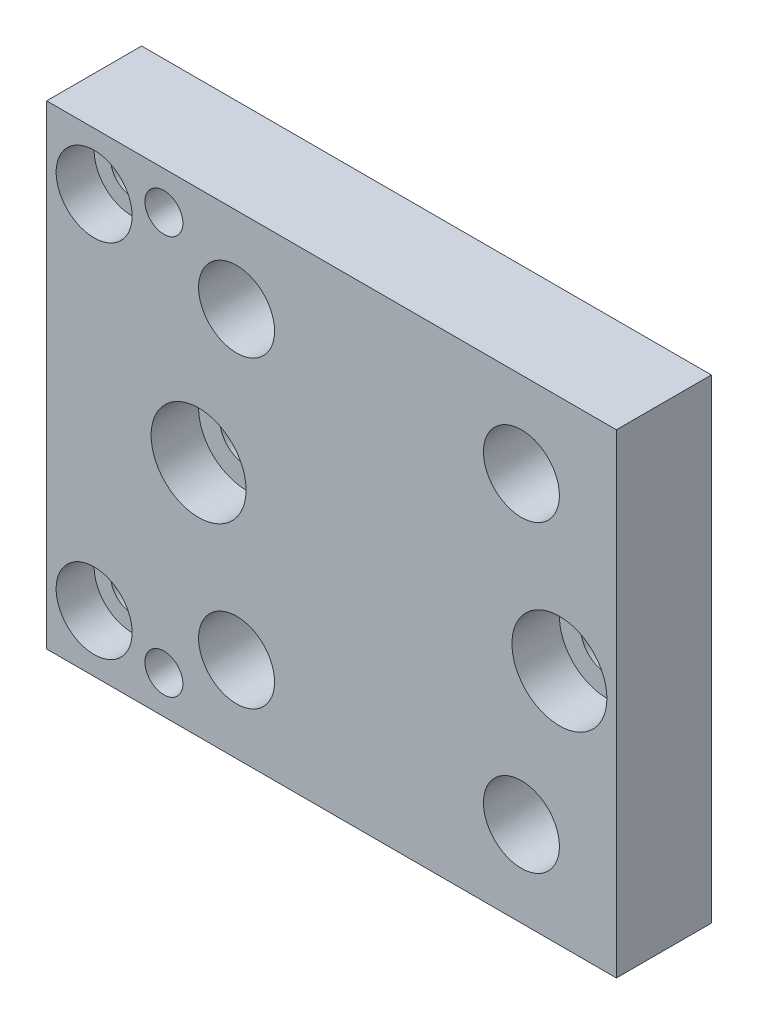
ISO-10303-21;
HEADER;
FILE_DESCRIPTION(('STEP AP214'),'2;1');
FILE_NAME('part.step','',(''),(''),'','','');
FILE_SCHEMA(('AUTOMOTIVE_DESIGN { 1 0 10303 214 1 1 1 1 }'));
ENDSEC;
DATA;
#1=APPLICATION_CONTEXT('core data for automotive mechanical design processes');
#2=APPLICATION_PROTOCOL_DEFINITION('international standard','automotive_design',2000,#1);
#3=PRODUCT_CONTEXT('',#1,'mechanical');
#4=PRODUCT('Part','Part','',(#3));
#5=PRODUCT_RELATED_PRODUCT_CATEGORY('part','',(#4));
#6=PRODUCT_DEFINITION_FORMATION('','',#4);
#7=PRODUCT_DEFINITION_CONTEXT('part definition',#1,'design');
#8=PRODUCT_DEFINITION('design','',#6,#7);
#9=PRODUCT_DEFINITION_SHAPE('','',#8);
#10=(LENGTH_UNIT() NAMED_UNIT(*) SI_UNIT(.MILLI.,.METRE.));
#11=(NAMED_UNIT(*) PLANE_ANGLE_UNIT() SI_UNIT($,.RADIAN.));
#12=(NAMED_UNIT(*) SI_UNIT($,.STERADIAN.) SOLID_ANGLE_UNIT());
#13=UNCERTAINTY_MEASURE_WITH_UNIT(LENGTH_MEASURE(1.E-05),#10,'distance_accuracy_value','');
#14=(GEOMETRIC_REPRESENTATION_CONTEXT(3) GLOBAL_UNCERTAINTY_ASSIGNED_CONTEXT((#13)) GLOBAL_UNIT_ASSIGNED_CONTEXT((#10,
#11,#12)) REPRESENTATION_CONTEXT('',''));
#15=CARTESIAN_POINT('',(0.,0.,0.));
#16=DIRECTION('',(0.,0.,1.));
#17=DIRECTION('',(1.,0.,0.));
#18=AXIS2_PLACEMENT_3D('',#15,#16,#17);
#19=CARTESIAN_POINT('',(-6.,25.,10.));
#20=DIRECTION('',(0.,0.,-1.));
#21=DIRECTION('',(-1.,0.,0.));
#22=AXIS2_PLACEMENT_3D('',#19,#20,#21);
#23=CYLINDRICAL_SURFACE('',#22,2.75);
#24=CARTESIAN_POINT('',(-6.,25.,0.));
#25=DIRECTION('',(0.,0.,1.));
#26=DIRECTION('',(1.,0.,0.));
#27=AXIS2_PLACEMENT_3D('',#24,#25,#26);
#28=CIRCLE('',#27,2.75);
#29=CARTESIAN_POINT('',(-3.25,25.,0.));
#30=VERTEX_POINT('',#29);
#31=EDGE_CURVE('E153',#30,#30,#28,.T.);
#32=ORIENTED_EDGE('',*,*,#31,.F.);
#33=EDGE_LOOP('',(#32));
#34=FACE_BOUND('',#33,.T.);
#35=CARTESIAN_POINT('',(-6.,25.,5.));
#36=DIRECTION('',(0.,0.,1.));
#37=DIRECTION('',(1.,0.,0.));
#38=AXIS2_PLACEMENT_3D('',#35,#36,#37);
#39=CIRCLE('',#38,2.75);
#40=CARTESIAN_POINT('',(-3.25,25.,5.));
#41=VERTEX_POINT('',#40);
#42=EDGE_CURVE('E37',#41,#41,#39,.T.);
#43=ORIENTED_EDGE('',*,*,#42,.T.);
#44=EDGE_LOOP('',(#43));
#45=FACE_BOUND('',#44,.T.);
#46=ADVANCED_FACE('F33',(#34,#45),#23,.F.);
#47=CARTESIAN_POINT('',(-44.,25.,10.));
#48=DIRECTION('',(0.,0.,-1.));
#49=DIRECTION('',(-1.,0.,0.));
#50=AXIS2_PLACEMENT_3D('',#47,#48,#49);
#51=CYLINDRICAL_SURFACE('',#50,2.75);
#52=CARTESIAN_POINT('',(-44.,25.,0.));
#53=DIRECTION('',(0.,0.,1.));
#54=DIRECTION('',(1.,0.,0.));
#55=AXIS2_PLACEMENT_3D('',#52,#53,#54);
#56=CIRCLE('',#55,2.75);
#57=CARTESIAN_POINT('',(-41.25,25.,0.));
#58=VERTEX_POINT('',#57);
#59=EDGE_CURVE('E158',#58,#58,#56,.T.);
#60=ORIENTED_EDGE('',*,*,#59,.F.);
#61=EDGE_LOOP('',(#60));
#62=FACE_BOUND('',#61,.T.);
#63=CARTESIAN_POINT('',(-44.,25.,5.));
#64=DIRECTION('',(0.,0.,1.));
#65=DIRECTION('',(1.,0.,0.));
#66=AXIS2_PLACEMENT_3D('',#63,#64,#65);
#67=CIRCLE('',#66,2.75);
#68=CARTESIAN_POINT('',(-41.25,25.,5.));
#69=VERTEX_POINT('',#68);
#70=EDGE_CURVE('E119',#69,#69,#67,.T.);
#71=ORIENTED_EDGE('',*,*,#70,.T.);
#72=EDGE_LOOP('',(#71));
#73=FACE_BOUND('',#72,.T.);
#74=ADVANCED_FACE('F210',(#62,#73),#51,.F.);
#75=CARTESIAN_POINT('',(-55.,5.99999999999999,10.));
#76=DIRECTION('',(0.,0.,-1.));
#77=DIRECTION('',(-1.,0.,0.));
#78=AXIS2_PLACEMENT_3D('',#75,#76,#77);
#79=CYLINDRICAL_SURFACE('',#78,2.25);
#80=CARTESIAN_POINT('',(-55.,5.99999999999999,0.));
#81=DIRECTION('',(0.,0.,1.));
#82=DIRECTION('',(1.,0.,0.));
#83=AXIS2_PLACEMENT_3D('',#80,#81,#82);
#84=CIRCLE('',#83,2.25);
#85=CARTESIAN_POINT('',(-52.75,5.99999999999999,0.));
#86=VERTEX_POINT('',#85);
#87=EDGE_CURVE('E161',#86,#86,#84,.T.);
#88=ORIENTED_EDGE('',*,*,#87,.F.);
#89=EDGE_LOOP('',(#88));
#90=FACE_BOUND('',#89,.T.);
#91=CARTESIAN_POINT('',(-55.,5.99999999999999,6.));
#92=DIRECTION('',(0.,0.,1.));
#93=DIRECTION('',(1.,0.,0.));
#94=AXIS2_PLACEMENT_3D('',#91,#92,#93);
#95=CIRCLE('',#94,2.25);
#96=CARTESIAN_POINT('',(-52.75,5.99999999999999,6.));
#97=VERTEX_POINT('',#96);
#98=EDGE_CURVE('E115',#97,#97,#95,.T.);
#99=ORIENTED_EDGE('',*,*,#98,.T.);
#100=EDGE_LOOP('',(#99));
#101=FACE_BOUND('',#100,.T.);
#102=ADVANCED_FACE('F216',(#90,#101),#79,.F.);
#103=CARTESIAN_POINT('',(-55.,44.,10.));
#104=DIRECTION('',(0.,0.,-1.));
#105=DIRECTION('',(-1.,0.,0.));
#106=AXIS2_PLACEMENT_3D('',#103,#104,#105);
#107=CYLINDRICAL_SURFACE('',#106,2.25);
#108=CARTESIAN_POINT('',(-55.,44.,0.));
#109=DIRECTION('',(0.,0.,1.));
#110=DIRECTION('',(1.,0.,0.));
#111=AXIS2_PLACEMENT_3D('',#108,#109,#110);
#112=CIRCLE('',#111,2.25);
#113=CARTESIAN_POINT('',(-52.75,44.,0.));
#114=VERTEX_POINT('',#113);
#115=EDGE_CURVE('E164',#114,#114,#112,.T.);
#116=ORIENTED_EDGE('',*,*,#115,.F.);
#117=EDGE_LOOP('',(#116));
#118=FACE_BOUND('',#117,.T.);
#119=CARTESIAN_POINT('',(-55.,44.,6.));
#120=DIRECTION('',(0.,0.,1.));
#121=DIRECTION('',(1.,0.,0.));
#122=AXIS2_PLACEMENT_3D('',#119,#120,#121);
#123=CIRCLE('',#122,2.25);
#124=CARTESIAN_POINT('',(-52.75,44.,6.));
#125=VERTEX_POINT('',#124);
#126=EDGE_CURVE('E110',#125,#125,#123,.T.);
#127=ORIENTED_EDGE('',*,*,#126,.T.);
#128=EDGE_LOOP('',(#127));
#129=FACE_BOUND('',#128,.T.);
#130=ADVANCED_FACE('F227',(#118,#129),#107,.F.);
#131=CARTESIAN_POINT('',(0.,0.,10.));
#132=DIRECTION('',(0.,0.,1.));
#133=DIRECTION('',(1.,0.,0.));
#134=AXIS2_PLACEMENT_3D('',#131,#132,#133);
#135=PLANE('',#134);
#136=CARTESIAN_POINT('',(-6.,25.,10.));
#137=DIRECTION('',(0.,0.,1.));
#138=DIRECTION('',(1.,0.,0.));
#139=AXIS2_PLACEMENT_3D('',#136,#137,#138);
#140=CIRCLE('',#139,5.);
#141=CARTESIAN_POINT('',(-0.999999999999999,25.,10.));
#142=VERTEX_POINT('',#141);
#143=EDGE_CURVE('E135',#142,#142,#140,.T.);
#144=ORIENTED_EDGE('',*,*,#143,.F.);
#145=EDGE_LOOP('',(#144));
#146=FACE_BOUND('',#145,.T.);
#147=CARTESIAN_POINT('',(-44.,25.,10.));
#148=DIRECTION('',(0.,0.,1.));
#149=DIRECTION('',(1.,0.,0.));
#150=AXIS2_PLACEMENT_3D('',#147,#148,#149);
#151=CIRCLE('',#150,5.);
#152=CARTESIAN_POINT('',(-39.,25.,10.));
#153=VERTEX_POINT('',#152);
#154=EDGE_CURVE('E128',#153,#153,#151,.T.);
#155=ORIENTED_EDGE('',*,*,#154,.F.);
#156=EDGE_LOOP('',(#155));
#157=FACE_BOUND('',#156,.T.);
#158=CARTESIAN_POINT('',(-55.,5.99999999999999,10.));
#159=DIRECTION('',(0.,0.,1.));
#160=DIRECTION('',(1.,0.,0.));
#161=AXIS2_PLACEMENT_3D('',#158,#159,#160);
#162=CIRCLE('',#161,4.);
#163=CARTESIAN_POINT('',(-51.,5.99999999999999,10.));
#164=VERTEX_POINT('',#163);
#165=EDGE_CURVE('E121',#164,#164,#162,.T.);
#166=ORIENTED_EDGE('',*,*,#165,.F.);
#167=EDGE_LOOP('',(#166));
#168=FACE_BOUND('',#167,.T.);
#169=CARTESIAN_POINT('',(-55.,44.,10.));
#170=DIRECTION('',(0.,0.,1.));
#171=DIRECTION('',(1.,0.,0.));
#172=AXIS2_PLACEMENT_3D('',#169,#170,#171);
#173=CIRCLE('',#172,4.);
#174=CARTESIAN_POINT('',(-51.,44.,10.));
#175=VERTEX_POINT('',#174);
#176=EDGE_CURVE('E117',#175,#175,#173,.T.);
#177=ORIENTED_EDGE('',*,*,#176,.F.);
#178=EDGE_LOOP('',(#177));
#179=FACE_BOUND('',#178,.T.);
#180=CARTESIAN_POINT('',(-47.6524990671277,46.,10.));
#181=DIRECTION('',(0.,0.,1.));
#182=DIRECTION('',(1.,0.,0.));
#183=AXIS2_PLACEMENT_3D('',#180,#181,#182);
#184=CIRCLE('',#183,2.);
#185=CARTESIAN_POINT('',(-45.6524990671277,46.,10.));
#186=VERTEX_POINT('',#185);
#187=EDGE_CURVE('E150',#186,#186,#184,.T.);
#188=ORIENTED_EDGE('',*,*,#187,.F.);
#189=EDGE_LOOP('',(#188));
#190=FACE_BOUND('',#189,.T.);
#191=CARTESIAN_POINT('',(-40.,9.,10.));
#192=DIRECTION('',(0.,0.,1.));
#193=DIRECTION('',(1.,0.,0.));
#194=AXIS2_PLACEMENT_3D('',#191,#192,#193);
#195=CIRCLE('',#194,4.00000000000001);
#196=CARTESIAN_POINT('',(-36.,9.,10.));
#197=VERTEX_POINT('',#196);
#198=EDGE_CURVE('E174',#197,#197,#195,.T.);
#199=ORIENTED_EDGE('',*,*,#198,.F.);
#200=EDGE_LOOP('',(#199));
#201=FACE_BOUND('',#200,.T.);
#202=CARTESIAN_POINT('',(-10.,41.,10.));
#203=DIRECTION('',(0.,0.,1.));
#204=DIRECTION('',(1.,0.,0.));
#205=AXIS2_PLACEMENT_3D('',#202,#203,#204);
#206=CIRCLE('',#205,4.);
#207=CARTESIAN_POINT('',(-6.,41.,10.));
#208=VERTEX_POINT('',#207);
#209=EDGE_CURVE('E104',#208,#208,#206,.T.);
#210=ORIENTED_EDGE('',*,*,#209,.F.);
#211=EDGE_LOOP('',(#210));
#212=FACE_BOUND('',#211,.T.);
#213=DIRECTION('',(0.,1.,0.));
#214=VECTOR('',#213,1.);
#215=CARTESIAN_POINT('',(0.,0.,10.));
#216=LINE('',#215,#214);
#217=CARTESIAN_POINT('',(0.,0.,10.));
#218=VERTEX_POINT('',#217);
#219=CARTESIAN_POINT('',(0.,50.,10.));
#220=VERTEX_POINT('',#219);
#221=EDGE_CURVE('E88',#218,#220,#216,.T.);
#222=ORIENTED_EDGE('',*,*,#221,.T.);
#223=DIRECTION('',(-1.,0.,0.));
#224=VECTOR('',#223,1.);
#225=CARTESIAN_POINT('',(0.,50.,10.));
#226=LINE('',#225,#224);
#227=CARTESIAN_POINT('',(-60.,50.,10.));
#228=VERTEX_POINT('',#227);
#229=EDGE_CURVE('E82',#220,#228,#226,.T.);
#230=ORIENTED_EDGE('',*,*,#229,.T.);
#231=DIRECTION('',(0.,-1.,0.));
#232=VECTOR('',#231,1.);
#233=CARTESIAN_POINT('',(-60.,0.,10.));
#234=LINE('',#233,#232);
#235=CARTESIAN_POINT('',(-60.,0.,10.));
#236=VERTEX_POINT('',#235);
#237=EDGE_CURVE('E86',#228,#236,#234,.T.);
#238=ORIENTED_EDGE('',*,*,#237,.T.);
#239=DIRECTION('',(1.,0.,0.));
#240=VECTOR('',#239,1.);
#241=CARTESIAN_POINT('',(0.,0.,10.));
#242=LINE('',#241,#240);
#243=EDGE_CURVE('E52',#236,#218,#242,.T.);
#244=ORIENTED_EDGE('',*,*,#243,.T.);
#245=EDGE_LOOP('',(#222,#230,#238,#244));
#246=FACE_BOUND('',#245,.T.);
#247=CARTESIAN_POINT('',(-10.,9.,10.));
#248=DIRECTION('',(0.,0.,1.));
#249=DIRECTION('',(1.,0.,0.));
#250=AXIS2_PLACEMENT_3D('',#247,#248,#249);
#251=CIRCLE('',#250,4.);
#252=CARTESIAN_POINT('',(-6.,9.,10.));
#253=VERTEX_POINT('',#252);
#254=EDGE_CURVE('E180',#253,#253,#251,.T.);
#255=ORIENTED_EDGE('',*,*,#254,.F.);
#256=EDGE_LOOP('',(#255));
#257=FACE_BOUND('',#256,.T.);
#258=CARTESIAN_POINT('',(-40.,41.,10.));
#259=DIRECTION('',(0.,0.,1.));
#260=DIRECTION('',(1.,0.,0.));
#261=AXIS2_PLACEMENT_3D('',#258,#259,#260);
#262=CIRCLE('',#261,4.00000000000001);
#263=CARTESIAN_POINT('',(-36.,41.,10.));
#264=VERTEX_POINT('',#263);
#265=EDGE_CURVE('E168',#264,#264,#262,.T.);
#266=ORIENTED_EDGE('',*,*,#265,.F.);
#267=EDGE_LOOP('',(#266));
#268=FACE_BOUND('',#267,.T.);
#269=CARTESIAN_POINT('',(-47.6524990671277,3.99999999999999,10.));
#270=DIRECTION('',(0.,0.,1.));
#271=DIRECTION('',(1.,0.,0.));
#272=AXIS2_PLACEMENT_3D('',#269,#270,#271);
#273=CIRCLE('',#272,2.);
#274=CARTESIAN_POINT('',(-45.6524990671277,3.99999999999999,10.));
#275=VERTEX_POINT('',#274);
#276=EDGE_CURVE('E144',#275,#275,#273,.T.);
#277=ORIENTED_EDGE('',*,*,#276,.F.);
#278=EDGE_LOOP('',(#277));
#279=FACE_BOUND('',#278,.T.);
#280=ADVANCED_FACE('F83',(#146,#157,#168,#179,#190,#201,#212,#246,#257,#268,#279),#135,.T.);
#281=CARTESIAN_POINT('',(0.,0.,0.));
#282=DIRECTION('',(0.,0.,1.));
#283=DIRECTION('',(1.,0.,0.));
#284=AXIS2_PLACEMENT_3D('',#281,#282,#283);
#285=PLANE('',#284);
#286=DIRECTION('',(0.,1.,0.));
#287=VECTOR('',#286,1.);
#288=CARTESIAN_POINT('',(0.,0.,0.));
#289=LINE('',#288,#287);
#290=CARTESIAN_POINT('',(0.,0.,0.));
#291=VERTEX_POINT('',#290);
#292=CARTESIAN_POINT('',(0.,50.,0.));
#293=VERTEX_POINT('',#292);
#294=EDGE_CURVE('E101',#291,#293,#289,.T.);
#295=ORIENTED_EDGE('',*,*,#294,.F.);
#296=DIRECTION('',(1.,0.,0.));
#297=VECTOR('',#296,1.);
#298=CARTESIAN_POINT('',(0.,0.,0.));
#299=LINE('',#298,#297);
#300=CARTESIAN_POINT('',(-60.,0.,0.));
#301=VERTEX_POINT('',#300);
#302=EDGE_CURVE('E75',#301,#291,#299,.T.);
#303=ORIENTED_EDGE('',*,*,#302,.F.);
#304=DIRECTION('',(0.,-1.,0.));
#305=VECTOR('',#304,1.);
#306=CARTESIAN_POINT('',(-60.,0.,0.));
#307=LINE('',#306,#305);
#308=CARTESIAN_POINT('',(-60.,50.,0.));
#309=VERTEX_POINT('',#308);
#310=EDGE_CURVE('E69',#309,#301,#307,.T.);
#311=ORIENTED_EDGE('',*,*,#310,.F.);
#312=DIRECTION('',(-1.,0.,0.));
#313=VECTOR('',#312,1.);
#314=CARTESIAN_POINT('',(0.,50.,0.));
#315=LINE('',#314,#313);
#316=EDGE_CURVE('E92',#293,#309,#315,.T.);
#317=ORIENTED_EDGE('',*,*,#316,.F.);
#318=EDGE_LOOP('',(#295,#303,#311,#317));
#319=FACE_BOUND('',#318,.T.);
#320=CARTESIAN_POINT('',(-10.,41.,0.));
#321=DIRECTION('',(0.,0.,1.));
#322=DIRECTION('',(1.,0.,0.));
#323=AXIS2_PLACEMENT_3D('',#320,#321,#322);
#324=CIRCLE('',#323,4.);
#325=CARTESIAN_POINT('',(-6.,41.,0.));
#326=VERTEX_POINT('',#325);
#327=EDGE_CURVE('E183',#326,#326,#324,.T.);
#328=ORIENTED_EDGE('',*,*,#327,.T.);
#329=EDGE_LOOP('',(#328));
#330=FACE_BOUND('',#329,.T.);
#331=CARTESIAN_POINT('',(-10.,9.,0.));
#332=DIRECTION('',(0.,0.,1.));
#333=DIRECTION('',(1.,0.,0.));
#334=AXIS2_PLACEMENT_3D('',#331,#332,#333);
#335=CIRCLE('',#334,4.);
#336=CARTESIAN_POINT('',(-6.,9.,0.));
#337=VERTEX_POINT('',#336);
#338=EDGE_CURVE('E177',#337,#337,#335,.T.);
#339=ORIENTED_EDGE('',*,*,#338,.T.);
#340=EDGE_LOOP('',(#339));
#341=FACE_BOUND('',#340,.T.);
#342=CARTESIAN_POINT('',(-40.,9.,0.));
#343=DIRECTION('',(0.,0.,1.));
#344=DIRECTION('',(1.,0.,0.));
#345=AXIS2_PLACEMENT_3D('',#342,#343,#344);
#346=CIRCLE('',#345,4.00000000000001);
#347=CARTESIAN_POINT('',(-36.,9.,0.));
#348=VERTEX_POINT('',#347);
#349=EDGE_CURVE('E171',#348,#348,#346,.T.);
#350=ORIENTED_EDGE('',*,*,#349,.T.);
#351=EDGE_LOOP('',(#350));
#352=FACE_BOUND('',#351,.T.);
#353=CARTESIAN_POINT('',(-40.,41.,0.));
#354=DIRECTION('',(0.,0.,1.));
#355=DIRECTION('',(1.,0.,0.));
#356=AXIS2_PLACEMENT_3D('',#353,#354,#355);
#357=CIRCLE('',#356,4.00000000000001);
#358=CARTESIAN_POINT('',(-36.,41.,0.));
#359=VERTEX_POINT('',#358);
#360=EDGE_CURVE('E167',#359,#359,#357,.T.);
#361=ORIENTED_EDGE('',*,*,#360,.T.);
#362=EDGE_LOOP('',(#361));
#363=FACE_BOUND('',#362,.T.);
#364=ORIENTED_EDGE('',*,*,#115,.T.);
#365=EDGE_LOOP('',(#364));
#366=FACE_BOUND('',#365,.T.);
#367=ORIENTED_EDGE('',*,*,#87,.T.);
#368=EDGE_LOOP('',(#367));
#369=FACE_BOUND('',#368,.T.);
#370=ORIENTED_EDGE('',*,*,#59,.T.);
#371=EDGE_LOOP('',(#370));
#372=FACE_BOUND('',#371,.T.);
#373=ORIENTED_EDGE('',*,*,#31,.T.);
#374=EDGE_LOOP('',(#373));
#375=FACE_BOUND('',#374,.T.);
#376=CARTESIAN_POINT('',(-47.6524990671277,46.,0.));
#377=DIRECTION('',(0.,0.,1.));
#378=DIRECTION('',(1.,0.,0.));
#379=AXIS2_PLACEMENT_3D('',#376,#377,#378);
#380=CIRCLE('',#379,2.);
#381=CARTESIAN_POINT('',(-45.6524990671277,46.,0.));
#382=VERTEX_POINT('',#381);
#383=EDGE_CURVE('E147',#382,#382,#380,.T.);
#384=ORIENTED_EDGE('',*,*,#383,.T.);
#385=EDGE_LOOP('',(#384));
#386=FACE_BOUND('',#385,.T.);
#387=CARTESIAN_POINT('',(-47.6524990671277,3.99999999999999,0.));
#388=DIRECTION('',(0.,0.,1.));
#389=DIRECTION('',(1.,0.,0.));
#390=AXIS2_PLACEMENT_3D('',#387,#388,#389);
#391=CIRCLE('',#390,2.);
#392=CARTESIAN_POINT('',(-45.6524990671277,3.99999999999999,0.));
#393=VERTEX_POINT('',#392);
#394=EDGE_CURVE('E113',#393,#393,#391,.T.);
#395=ORIENTED_EDGE('',*,*,#394,.T.);
#396=EDGE_LOOP('',(#395));
#397=FACE_BOUND('',#396,.T.);
#398=ADVANCED_FACE('F191',(#319,#330,#341,#352,#363,#366,#369,#372,#375,#386,#397),#285,.F.);
#399=CARTESIAN_POINT('',(0.,0.,10.));
#400=DIRECTION('',(-1.,0.,0.));
#401=DIRECTION('',(0.,-1.,0.));
#402=AXIS2_PLACEMENT_3D('',#399,#400,#401);
#403=PLANE('',#402);
#404=ORIENTED_EDGE('',*,*,#294,.T.);
#405=DIRECTION('',(0.,0.,-1.));
#406=VECTOR('',#405,1.);
#407=CARTESIAN_POINT('',(0.,50.,10.));
#408=LINE('',#407,#406);
#409=EDGE_CURVE('E11',#220,#293,#408,.T.);
#410=ORIENTED_EDGE('',*,*,#409,.F.);
#411=ORIENTED_EDGE('',*,*,#221,.F.);
#412=DIRECTION('',(0.,0.,-1.));
#413=VECTOR('',#412,1.);
#414=CARTESIAN_POINT('',(0.,0.,10.));
#415=LINE('',#414,#413);
#416=EDGE_CURVE('E97',#218,#291,#415,.T.);
#417=ORIENTED_EDGE('',*,*,#416,.T.);
#418=EDGE_LOOP('',(#404,#410,#411,#417));
#419=FACE_BOUND('',#418,.T.);
#420=ADVANCED_FACE('F35',(#419),#403,.F.);
#421=CARTESIAN_POINT('',(0.,50.,10.));
#422=DIRECTION('',(0.,-1.,0.));
#423=DIRECTION('',(0.,0.,-1.));
#424=AXIS2_PLACEMENT_3D('',#421,#422,#423);
#425=PLANE('',#424);
#426=ORIENTED_EDGE('',*,*,#316,.T.);
#427=DIRECTION('',(0.,0.,-1.));
#428=VECTOR('',#427,1.);
#429=CARTESIAN_POINT('',(-60.,50.,10.));
#430=LINE('',#429,#428);
#431=EDGE_CURVE('E43',#228,#309,#430,.T.);
#432=ORIENTED_EDGE('',*,*,#431,.F.);
#433=ORIENTED_EDGE('',*,*,#229,.F.);
#434=ORIENTED_EDGE('',*,*,#409,.T.);
#435=EDGE_LOOP('',(#426,#432,#433,#434));
#436=FACE_BOUND('',#435,.T.);
#437=ADVANCED_FACE('F91',(#436),#425,.F.);
#438=CARTESIAN_POINT('',(-60.,0.,10.));
#439=DIRECTION('',(1.,0.,0.));
#440=DIRECTION('',(0.,0.,-1.));
#441=AXIS2_PLACEMENT_3D('',#438,#439,#440);
#442=PLANE('',#441);
#443=ORIENTED_EDGE('',*,*,#310,.T.);
#444=DIRECTION('',(0.,0.,-1.));
#445=VECTOR('',#444,1.);
#446=CARTESIAN_POINT('',(-60.,0.,10.));
#447=LINE('',#446,#445);
#448=EDGE_CURVE('E93',#236,#301,#447,.T.);
#449=ORIENTED_EDGE('',*,*,#448,.F.);
#450=ORIENTED_EDGE('',*,*,#237,.F.);
#451=ORIENTED_EDGE('',*,*,#431,.T.);
#452=EDGE_LOOP('',(#443,#449,#450,#451));
#453=FACE_BOUND('',#452,.T.);
#454=ADVANCED_FACE('F95',(#453),#442,.F.);
#455=CARTESIAN_POINT('',(0.,0.,10.));
#456=DIRECTION('',(0.,1.,0.));
#457=DIRECTION('',(-1.,0.,0.));
#458=AXIS2_PLACEMENT_3D('',#455,#456,#457);
#459=PLANE('',#458);
#460=ORIENTED_EDGE('',*,*,#302,.T.);
#461=ORIENTED_EDGE('',*,*,#416,.F.);
#462=ORIENTED_EDGE('',*,*,#243,.F.);
#463=ORIENTED_EDGE('',*,*,#448,.T.);
#464=EDGE_LOOP('',(#460,#461,#462,#463));
#465=FACE_BOUND('',#464,.T.);
#466=ADVANCED_FACE('F197',(#465),#459,.F.);
#467=CARTESIAN_POINT('',(-10.,41.,10.));
#468=DIRECTION('',(0.,0.,-1.));
#469=DIRECTION('',(-1.,0.,0.));
#470=AXIS2_PLACEMENT_3D('',#467,#468,#469);
#471=CYLINDRICAL_SURFACE('',#470,4.);
#472=ORIENTED_EDGE('',*,*,#209,.T.);
#473=EDGE_LOOP('',(#472));
#474=FACE_BOUND('',#473,.T.);
#475=ORIENTED_EDGE('',*,*,#327,.F.);
#476=EDGE_LOOP('',(#475));
#477=FACE_BOUND('',#476,.T.);
#478=ADVANCED_FACE('F194',(#474,#477),#471,.F.);
#479=CARTESIAN_POINT('',(-10.,9.,10.));
#480=DIRECTION('',(0.,0.,-1.));
#481=DIRECTION('',(-1.,0.,0.));
#482=AXIS2_PLACEMENT_3D('',#479,#480,#481);
#483=CYLINDRICAL_SURFACE('',#482,4.);
#484=ORIENTED_EDGE('',*,*,#254,.T.);
#485=EDGE_LOOP('',(#484));
#486=FACE_BOUND('',#485,.T.);
#487=ORIENTED_EDGE('',*,*,#338,.F.);
#488=EDGE_LOOP('',(#487));
#489=FACE_BOUND('',#488,.T.);
#490=ADVANCED_FACE('F196',(#486,#489),#483,.F.);
#491=CARTESIAN_POINT('',(-40.,9.,10.));
#492=DIRECTION('',(0.,0.,-1.));
#493=DIRECTION('',(-1.,0.,0.));
#494=AXIS2_PLACEMENT_3D('',#491,#492,#493);
#495=CYLINDRICAL_SURFACE('',#494,4.00000000000001);
#496=ORIENTED_EDGE('',*,*,#198,.T.);
#497=EDGE_LOOP('',(#496));
#498=FACE_BOUND('',#497,.T.);
#499=ORIENTED_EDGE('',*,*,#349,.F.);
#500=EDGE_LOOP('',(#499));
#501=FACE_BOUND('',#500,.T.);
#502=ADVANCED_FACE('F204',(#498,#501),#495,.F.);
#503=CARTESIAN_POINT('',(-40.,41.,10.));
#504=DIRECTION('',(0.,0.,-1.));
#505=DIRECTION('',(-1.,0.,0.));
#506=AXIS2_PLACEMENT_3D('',#503,#504,#505);
#507=CYLINDRICAL_SURFACE('',#506,4.00000000000001);
#508=ORIENTED_EDGE('',*,*,#265,.T.);
#509=EDGE_LOOP('',(#508));
#510=FACE_BOUND('',#509,.T.);
#511=ORIENTED_EDGE('',*,*,#360,.F.);
#512=EDGE_LOOP('',(#511));
#513=FACE_BOUND('',#512,.T.);
#514=ADVANCED_FACE('F232',(#510,#513),#507,.F.);
#515=CARTESIAN_POINT('',(-47.6524990671277,46.,10.));
#516=DIRECTION('',(0.,0.,-1.));
#517=DIRECTION('',(-1.,0.,0.));
#518=AXIS2_PLACEMENT_3D('',#515,#516,#517);
#519=CYLINDRICAL_SURFACE('',#518,2.);
#520=ORIENTED_EDGE('',*,*,#187,.T.);
#521=EDGE_LOOP('',(#520));
#522=FACE_BOUND('',#521,.T.);
#523=ORIENTED_EDGE('',*,*,#383,.F.);
#524=EDGE_LOOP('',(#523));
#525=FACE_BOUND('',#524,.T.);
#526=ADVANCED_FACE('F222',(#522,#525),#519,.F.);
#527=CARTESIAN_POINT('',(-47.6524990671277,3.99999999999999,10.));
#528=DIRECTION('',(0.,0.,-1.));
#529=DIRECTION('',(-1.,0.,0.));
#530=AXIS2_PLACEMENT_3D('',#527,#528,#529);
#531=CYLINDRICAL_SURFACE('',#530,2.);
#532=ORIENTED_EDGE('',*,*,#276,.T.);
#533=EDGE_LOOP('',(#532));
#534=FACE_BOUND('',#533,.T.);
#535=ORIENTED_EDGE('',*,*,#394,.F.);
#536=EDGE_LOOP('',(#535));
#537=FACE_BOUND('',#536,.T.);
#538=ADVANCED_FACE('F261',(#534,#537),#531,.F.);
#539=CARTESIAN_POINT('',(-55.,44.,6.));
#540=DIRECTION('',(0.,0.,1.));
#541=DIRECTION('',(1.,0.,0.));
#542=AXIS2_PLACEMENT_3D('',#539,#540,#541);
#543=CYLINDRICAL_SURFACE('',#542,4.);
#544=CARTESIAN_POINT('',(-55.,44.,6.));
#545=DIRECTION('',(0.,0.,1.));
#546=DIRECTION('',(1.,0.,0.));
#547=AXIS2_PLACEMENT_3D('',#544,#545,#546);
#548=CIRCLE('',#547,4.);
#549=CARTESIAN_POINT('',(-51.,44.,6.));
#550=VERTEX_POINT('',#549);
#551=EDGE_CURVE('E114',#550,#550,#548,.T.);
#552=ORIENTED_EDGE('',*,*,#551,.F.);
#553=EDGE_LOOP('',(#552));
#554=FACE_BOUND('',#553,.T.);
#555=ORIENTED_EDGE('',*,*,#176,.T.);
#556=EDGE_LOOP('',(#555));
#557=FACE_BOUND('',#556,.T.);
#558=ADVANCED_FACE('F263',(#554,#557),#543,.F.);
#559=CARTESIAN_POINT('',(-55.,44.,6.));
#560=DIRECTION('',(0.,0.,1.));
#561=DIRECTION('',(1.,0.,0.));
#562=AXIS2_PLACEMENT_3D('',#559,#560,#561);
#563=PLANE('',#562);
#564=ORIENTED_EDGE('',*,*,#126,.F.);
#565=EDGE_LOOP('',(#564));
#566=FACE_BOUND('',#565,.T.);
#567=ORIENTED_EDGE('',*,*,#551,.T.);
#568=EDGE_LOOP('',(#567));
#569=FACE_BOUND('',#568,.T.);
#570=ADVANCED_FACE('F269',(#566,#569),#563,.T.);
#571=CARTESIAN_POINT('',(-55.,5.99999999999999,6.));
#572=DIRECTION('',(0.,0.,1.));
#573=DIRECTION('',(1.,0.,0.));
#574=AXIS2_PLACEMENT_3D('',#571,#572,#573);
#575=CYLINDRICAL_SURFACE('',#574,4.);
#576=CARTESIAN_POINT('',(-55.,5.99999999999999,6.));
#577=DIRECTION('',(0.,0.,1.));
#578=DIRECTION('',(1.,0.,0.));
#579=AXIS2_PLACEMENT_3D('',#576,#577,#578);
#580=CIRCLE('',#579,4.);
#581=CARTESIAN_POINT('',(-51.,5.99999999999999,6.));
#582=VERTEX_POINT('',#581);
#583=EDGE_CURVE('E118',#582,#582,#580,.T.);
#584=ORIENTED_EDGE('',*,*,#583,.F.);
#585=EDGE_LOOP('',(#584));
#586=FACE_BOUND('',#585,.T.);
#587=ORIENTED_EDGE('',*,*,#165,.T.);
#588=EDGE_LOOP('',(#587));
#589=FACE_BOUND('',#588,.T.);
#590=ADVANCED_FACE('F276',(#586,#589),#575,.F.);
#591=CARTESIAN_POINT('',(-55.,5.99999999999999,6.));
#592=DIRECTION('',(0.,0.,1.));
#593=DIRECTION('',(1.,0.,0.));
#594=AXIS2_PLACEMENT_3D('',#591,#592,#593);
#595=PLANE('',#594);
#596=ORIENTED_EDGE('',*,*,#98,.F.);
#597=EDGE_LOOP('',(#596));
#598=FACE_BOUND('',#597,.T.);
#599=ORIENTED_EDGE('',*,*,#583,.T.);
#600=EDGE_LOOP('',(#599));
#601=FACE_BOUND('',#600,.T.);
#602=ADVANCED_FACE('F280',(#598,#601),#595,.T.);
#603=CARTESIAN_POINT('',(-44.,25.,5.));
#604=DIRECTION('',(0.,0.,1.));
#605=DIRECTION('',(1.,0.,0.));
#606=AXIS2_PLACEMENT_3D('',#603,#604,#605);
#607=CYLINDRICAL_SURFACE('',#606,5.);
#608=CARTESIAN_POINT('',(-44.,25.,5.));
#609=DIRECTION('',(0.,0.,1.));
#610=DIRECTION('',(1.,0.,0.));
#611=AXIS2_PLACEMENT_3D('',#608,#609,#610);
#612=CIRCLE('',#611,5.);
#613=CARTESIAN_POINT('',(-39.,25.,5.));
#614=VERTEX_POINT('',#613);
#615=EDGE_CURVE('E122',#614,#614,#612,.T.);
#616=ORIENTED_EDGE('',*,*,#615,.F.);
#617=EDGE_LOOP('',(#616));
#618=FACE_BOUND('',#617,.T.);
#619=ORIENTED_EDGE('',*,*,#154,.T.);
#620=EDGE_LOOP('',(#619));
#621=FACE_BOUND('',#620,.T.);
#622=ADVANCED_FACE('F284',(#618,#621),#607,.F.);
#623=CARTESIAN_POINT('',(-44.,25.,5.));
#624=DIRECTION('',(0.,0.,1.));
#625=DIRECTION('',(1.,0.,0.));
#626=AXIS2_PLACEMENT_3D('',#623,#624,#625);
#627=PLANE('',#626);
#628=ORIENTED_EDGE('',*,*,#70,.F.);
#629=EDGE_LOOP('',(#628));
#630=FACE_BOUND('',#629,.T.);
#631=ORIENTED_EDGE('',*,*,#615,.T.);
#632=EDGE_LOOP('',(#631));
#633=FACE_BOUND('',#632,.T.);
#634=ADVANCED_FACE('F288',(#630,#633),#627,.T.);
#635=CARTESIAN_POINT('',(-6.,25.,5.));
#636=DIRECTION('',(0.,0.,1.));
#637=DIRECTION('',(1.,0.,0.));
#638=AXIS2_PLACEMENT_3D('',#635,#636,#637);
#639=CYLINDRICAL_SURFACE('',#638,5.);
#640=CARTESIAN_POINT('',(-6.,25.,5.));
#641=DIRECTION('',(0.,0.,1.));
#642=DIRECTION('',(1.,0.,0.));
#643=AXIS2_PLACEMENT_3D('',#640,#641,#642);
#644=CIRCLE('',#643,5.);
#645=CARTESIAN_POINT('',(-0.999999999999999,25.,5.));
#646=VERTEX_POINT('',#645);
#647=EDGE_CURVE('E307',#646,#646,#644,.T.);
#648=ORIENTED_EDGE('',*,*,#647,.F.);
#649=EDGE_LOOP('',(#648));
#650=FACE_BOUND('',#649,.T.);
#651=ORIENTED_EDGE('',*,*,#143,.T.);
#652=EDGE_LOOP('',(#651));
#653=FACE_BOUND('',#652,.T.);
#654=ADVANCED_FACE('F292',(#650,#653),#639,.F.);
#655=CARTESIAN_POINT('',(-6.,25.,5.));
#656=DIRECTION('',(0.,0.,1.));
#657=DIRECTION('',(1.,0.,0.));
#658=AXIS2_PLACEMENT_3D('',#655,#656,#657);
#659=PLANE('',#658);
#660=ORIENTED_EDGE('',*,*,#42,.F.);
#661=EDGE_LOOP('',(#660));
#662=FACE_BOUND('',#661,.T.);
#663=ORIENTED_EDGE('',*,*,#647,.T.);
#664=EDGE_LOOP('',(#663));
#665=FACE_BOUND('',#664,.T.);
#666=ADVANCED_FACE('F296',(#662,#665),#659,.T.);
#667=CLOSED_SHELL('',(#46,#74,#102,#130,#280,#398,#420,#437,#454,#466,#478,#490,#502,#514,#526,
#538,#558,#570,#590,#602,#622,#634,#654,#666));
#668=MANIFOLD_SOLID_BREP('B2',#667);
#669=ADVANCED_BREP_SHAPE_REPRESENTATION('',(#18,#668),#14);
#670=SHAPE_DEFINITION_REPRESENTATION(#9,#669);
ENDSEC;
END-ISO-10303-21;
